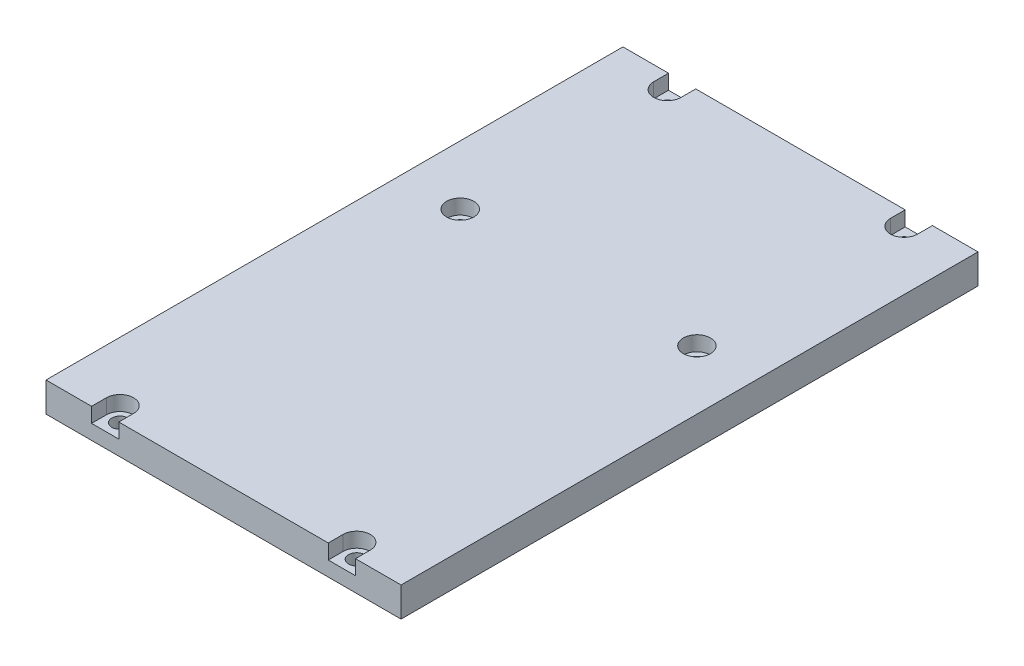
ISO-10303-21;
HEADER;
FILE_DESCRIPTION(('STEP AP214'),'2;1');
FILE_NAME('part.step','',(''),(''),'','','');
FILE_SCHEMA(('AUTOMOTIVE_DESIGN { 1 0 10303 214 1 1 1 1 }'));
ENDSEC;
DATA;
#1=APPLICATION_CONTEXT('core data for automotive mechanical design processes');
#2=APPLICATION_PROTOCOL_DEFINITION('international standard','automotive_design',2000,#1);
#3=PRODUCT_CONTEXT('',#1,'mechanical');
#4=PRODUCT('Part','Part','',(#3));
#5=PRODUCT_RELATED_PRODUCT_CATEGORY('part','',(#4));
#6=PRODUCT_DEFINITION_FORMATION('','',#4);
#7=PRODUCT_DEFINITION_CONTEXT('part definition',#1,'design');
#8=PRODUCT_DEFINITION('design','',#6,#7);
#9=PRODUCT_DEFINITION_SHAPE('','',#8);
#10=(LENGTH_UNIT() NAMED_UNIT(*) SI_UNIT(.MILLI.,.METRE.));
#11=(NAMED_UNIT(*) PLANE_ANGLE_UNIT() SI_UNIT($,.RADIAN.));
#12=(NAMED_UNIT(*) SI_UNIT($,.STERADIAN.) SOLID_ANGLE_UNIT());
#13=UNCERTAINTY_MEASURE_WITH_UNIT(LENGTH_MEASURE(1.E-05),#10,'distance_accuracy_value','');
#14=(GEOMETRIC_REPRESENTATION_CONTEXT(3) GLOBAL_UNCERTAINTY_ASSIGNED_CONTEXT((#13)) GLOBAL_UNIT_ASSIGNED_CONTEXT((#10,
#11,#12)) REPRESENTATION_CONTEXT('',''));
#15=CARTESIAN_POINT('',(0.,0.,0.));
#16=DIRECTION('',(0.,0.,1.));
#17=DIRECTION('',(1.,0.,0.));
#18=AXIS2_PLACEMENT_3D('',#15,#16,#17);
#19=CARTESIAN_POINT('',(-57.4277992722671,0.,-66.2487077993988));
#20=DIRECTION('',(0.,1.,0.));
#21=DIRECTION('',(0.,0.,1.));
#22=AXIS2_PLACEMENT_3D('',#19,#20,#21);
#23=CYLINDRICAL_SURFACE('',#22,2.75);
#24=CARTESIAN_POINT('',(-57.4277992722671,0.,-66.2487077993988));
#25=DIRECTION('',(0.,1.,0.));
#26=DIRECTION('',(0.,0.,1.));
#27=AXIS2_PLACEMENT_3D('',#24,#25,#26);
#28=CIRCLE('',#27,2.75);
#29=CARTESIAN_POINT('',(-57.4277992722671,0.,-63.4987077993988));
#30=VERTEX_POINT('',#29);
#31=EDGE_CURVE('E307',#30,#30,#28,.T.);
#32=ORIENTED_EDGE('',*,*,#31,.F.);
#33=EDGE_LOOP('',(#32));
#34=FACE_BOUND('',#33,.T.);
#35=CARTESIAN_POINT('',(-57.4277992722671,5.,-66.2487077993988));
#36=DIRECTION('',(0.,1.,0.));
#37=DIRECTION('',(0.,0.,1.));
#38=AXIS2_PLACEMENT_3D('',#35,#36,#37);
#39=CIRCLE('',#38,2.75);
#40=CARTESIAN_POINT('',(-57.4277992722671,5.,-63.4987077993988));
#41=VERTEX_POINT('',#40);
#42=EDGE_CURVE('E37',#41,#41,#39,.F.);
#43=ORIENTED_EDGE('',*,*,#42,.F.);
#44=EDGE_LOOP('',(#43));
#45=FACE_BOUND('',#44,.T.);
#46=ADVANCED_FACE('F33',(#34,#45),#23,.F.);
#47=CARTESIAN_POINT('',(22.572200727733,0.,-66.2487077993988));
#48=DIRECTION('',(0.,1.,0.));
#49=DIRECTION('',(0.,0.,1.));
#50=AXIS2_PLACEMENT_3D('',#47,#48,#49);
#51=CYLINDRICAL_SURFACE('',#50,2.75);
#52=CARTESIAN_POINT('',(22.572200727733,0.,-66.2487077993988));
#53=DIRECTION('',(0.,1.,0.));
#54=DIRECTION('',(0.,0.,1.));
#55=AXIS2_PLACEMENT_3D('',#52,#53,#54);
#56=CIRCLE('',#55,2.75);
#57=CARTESIAN_POINT('',(22.572200727733,0.,-63.4987077993988));
#58=VERTEX_POINT('',#57);
#59=EDGE_CURVE('E310',#58,#58,#56,.T.);
#60=ORIENTED_EDGE('',*,*,#59,.F.);
#61=EDGE_LOOP('',(#60));
#62=FACE_BOUND('',#61,.T.);
#63=CARTESIAN_POINT('',(22.572200727733,5.,-66.2487077993988));
#64=DIRECTION('',(0.,1.,0.));
#65=DIRECTION('',(0.,0.,1.));
#66=AXIS2_PLACEMENT_3D('',#63,#64,#65);
#67=CIRCLE('',#66,2.75);
#68=CARTESIAN_POINT('',(22.572200727733,5.,-63.4987077993988));
#69=VERTEX_POINT('',#68);
#70=EDGE_CURVE('E227',#69,#69,#67,.F.);
#71=ORIENTED_EDGE('',*,*,#70,.F.);
#72=EDGE_LOOP('',(#71));
#73=FACE_BOUND('',#72,.T.);
#74=ADVANCED_FACE('F369',(#62,#73),#51,.F.);
#75=CARTESIAN_POINT('',(-57.4277992722671,0.,118.751292200601));
#76=DIRECTION('',(0.,1.,0.));
#77=DIRECTION('',(0.,0.,1.));
#78=AXIS2_PLACEMENT_3D('',#75,#76,#77);
#79=CYLINDRICAL_SURFACE('',#78,2.75);
#80=CARTESIAN_POINT('',(-57.4277992722671,0.,118.751292200601));
#81=DIRECTION('',(0.,1.,0.));
#82=DIRECTION('',(0.,0.,1.));
#83=AXIS2_PLACEMENT_3D('',#80,#81,#82);
#84=CIRCLE('',#83,2.75);
#85=CARTESIAN_POINT('',(-57.4277992722671,0.,121.501292200601));
#86=VERTEX_POINT('',#85);
#87=EDGE_CURVE('E319',#86,#86,#84,.T.);
#88=ORIENTED_EDGE('',*,*,#87,.F.);
#89=EDGE_LOOP('',(#88));
#90=FACE_BOUND('',#89,.T.);
#91=CARTESIAN_POINT('',(-57.4277992722671,5.,118.751292200601));
#92=DIRECTION('',(0.,1.,0.));
#93=DIRECTION('',(0.,0.,1.));
#94=AXIS2_PLACEMENT_3D('',#91,#92,#93);
#95=CIRCLE('',#94,2.75);
#96=CARTESIAN_POINT('',(-57.4277992722671,5.,121.501292200601));
#97=VERTEX_POINT('',#96);
#98=EDGE_CURVE('E255',#97,#97,#95,.F.);
#99=ORIENTED_EDGE('',*,*,#98,.F.);
#100=EDGE_LOOP('',(#99));
#101=FACE_BOUND('',#100,.T.);
#102=ADVANCED_FACE('F371',(#90,#101),#79,.F.);
#103=CARTESIAN_POINT('',(-57.4277992722671,0.,3.75129220060118));
#104=DIRECTION('',(0.,1.,0.));
#105=DIRECTION('',(0.,0.,1.));
#106=AXIS2_PLACEMENT_3D('',#103,#104,#105);
#107=CYLINDRICAL_SURFACE('',#106,2.75);
#108=CARTESIAN_POINT('',(-57.4277992722671,0.,3.75129220060118));
#109=DIRECTION('',(0.,1.,0.));
#110=DIRECTION('',(0.,0.,1.));
#111=AXIS2_PLACEMENT_3D('',#108,#109,#110);
#112=CIRCLE('',#111,2.75);
#113=CARTESIAN_POINT('',(-57.4277992722671,0.,6.50129220060118));
#114=VERTEX_POINT('',#113);
#115=EDGE_CURVE('E313',#114,#114,#112,.T.);
#116=ORIENTED_EDGE('',*,*,#115,.F.);
#117=EDGE_LOOP('',(#116));
#118=FACE_BOUND('',#117,.T.);
#119=CARTESIAN_POINT('',(-57.4277992722671,5.,3.75129220060118));
#120=DIRECTION('',(0.,1.,0.));
#121=DIRECTION('',(0.,0.,1.));
#122=AXIS2_PLACEMENT_3D('',#119,#120,#121);
#123=CIRCLE('',#122,2.75);
#124=CARTESIAN_POINT('',(-57.4277992722671,5.,6.50129220060118));
#125=VERTEX_POINT('',#124);
#126=EDGE_CURVE('E266',#125,#125,#123,.F.);
#127=ORIENTED_EDGE('',*,*,#126,.F.);
#128=EDGE_LOOP('',(#127));
#129=FACE_BOUND('',#128,.T.);
#130=ADVANCED_FACE('F378',(#118,#129),#107,.F.);
#131=CARTESIAN_POINT('',(22.572200727733,0.,3.75129220060118));
#132=DIRECTION('',(0.,1.,0.));
#133=DIRECTION('',(0.,0.,1.));
#134=AXIS2_PLACEMENT_3D('',#131,#132,#133);
#135=CYLINDRICAL_SURFACE('',#134,2.75);
#136=CARTESIAN_POINT('',(22.572200727733,0.,3.75129220060118));
#137=DIRECTION('',(0.,1.,0.));
#138=DIRECTION('',(0.,0.,1.));
#139=AXIS2_PLACEMENT_3D('',#136,#137,#138);
#140=CIRCLE('',#139,2.75);
#141=CARTESIAN_POINT('',(22.572200727733,0.,6.50129220060118));
#142=VERTEX_POINT('',#141);
#143=EDGE_CURVE('E316',#142,#142,#140,.T.);
#144=ORIENTED_EDGE('',*,*,#143,.F.);
#145=EDGE_LOOP('',(#144));
#146=FACE_BOUND('',#145,.T.);
#147=CARTESIAN_POINT('',(22.572200727733,5.,3.75129220060118));
#148=DIRECTION('',(0.,1.,0.));
#149=DIRECTION('',(0.,0.,1.));
#150=AXIS2_PLACEMENT_3D('',#147,#148,#149);
#151=CIRCLE('',#150,2.75);
#152=CARTESIAN_POINT('',(22.572200727733,5.,6.50129220060118));
#153=VERTEX_POINT('',#152);
#154=EDGE_CURVE('E273',#153,#153,#151,.F.);
#155=ORIENTED_EDGE('',*,*,#154,.F.);
#156=EDGE_LOOP('',(#155));
#157=FACE_BOUND('',#156,.T.);
#158=ADVANCED_FACE('F388',(#146,#157),#135,.F.);
#159=CARTESIAN_POINT('',(22.572200727733,0.,118.751292200601));
#160=DIRECTION('',(0.,1.,0.));
#161=DIRECTION('',(0.,0.,1.));
#162=AXIS2_PLACEMENT_3D('',#159,#160,#161);
#163=CYLINDRICAL_SURFACE('',#162,2.75);
#164=CARTESIAN_POINT('',(22.572200727733,0.,118.751292200601));
#165=DIRECTION('',(0.,1.,0.));
#166=DIRECTION('',(0.,0.,1.));
#167=AXIS2_PLACEMENT_3D('',#164,#165,#166);
#168=CIRCLE('',#167,2.75);
#169=CARTESIAN_POINT('',(22.572200727733,0.,121.501292200601));
#170=VERTEX_POINT('',#169);
#171=EDGE_CURVE('E322',#170,#170,#168,.T.);
#172=ORIENTED_EDGE('',*,*,#171,.F.);
#173=EDGE_LOOP('',(#172));
#174=FACE_BOUND('',#173,.T.);
#175=CARTESIAN_POINT('',(22.572200727733,5.,118.751292200601));
#176=DIRECTION('',(0.,1.,0.));
#177=DIRECTION('',(0.,0.,1.));
#178=AXIS2_PLACEMENT_3D('',#175,#176,#177);
#179=CIRCLE('',#178,2.75);
#180=CARTESIAN_POINT('',(22.572200727733,5.,121.501292200601));
#181=VERTEX_POINT('',#180);
#182=EDGE_CURVE('E299',#181,#181,#179,.F.);
#183=ORIENTED_EDGE('',*,*,#182,.F.);
#184=EDGE_LOOP('',(#183));
#185=FACE_BOUND('',#184,.T.);
#186=ADVANCED_FACE('F391',(#174,#185),#163,.F.);
#187=CARTESIAN_POINT('',(-77.4277992722671,10.,-71.2487077993988));
#188=DIRECTION('',(1.,0.,0.));
#189=DIRECTION('',(0.,0.,-1.));
#190=AXIS2_PLACEMENT_3D('',#187,#188,#189);
#191=PLANE('',#190);
#192=DIRECTION('',(0.,0.,1.));
#193=VECTOR('',#192,1.);
#194=CARTESIAN_POINT('',(-77.4277992722671,0.,-71.2487077993988));
#195=LINE('',#194,#193);
#196=CARTESIAN_POINT('',(-77.4277992722671,0.,-71.2487077993988));
#197=VERTEX_POINT('',#196);
#198=CARTESIAN_POINT('',(-77.427799272267,0.,123.751292200601));
#199=VERTEX_POINT('',#198);
#200=EDGE_CURVE('E325',#197,#199,#195,.T.);
#201=ORIENTED_EDGE('',*,*,#200,.T.);
#202=DIRECTION('',(0.,-1.,0.));
#203=VECTOR('',#202,1.);
#204=CARTESIAN_POINT('',(-77.427799272267,10.,123.751292200601));
#205=LINE('',#204,#203);
#206=CARTESIAN_POINT('',(-77.427799272267,10.,123.751292200601));
#207=VERTEX_POINT('',#206);
#208=EDGE_CURVE('E11',#207,#199,#205,.T.);
#209=ORIENTED_EDGE('',*,*,#208,.F.);
#210=DIRECTION('',(0.,0.,1.));
#211=VECTOR('',#210,1.);
#212=CARTESIAN_POINT('',(-77.4277992722671,10.,-71.2487077993988));
#213=LINE('',#212,#211);
#214=CARTESIAN_POINT('',(-77.4277992722671,10.,-71.2487077993988));
#215=VERTEX_POINT('',#214);
#216=EDGE_CURVE('E326',#215,#207,#213,.T.);
#217=ORIENTED_EDGE('',*,*,#216,.F.);
#218=DIRECTION('',(0.,-1.,0.));
#219=VECTOR('',#218,1.);
#220=CARTESIAN_POINT('',(-77.4277992722671,10.,-71.2487077993988));
#221=LINE('',#220,#219);
#222=EDGE_CURVE('E341',#215,#197,#221,.T.);
#223=ORIENTED_EDGE('',*,*,#222,.T.);
#224=EDGE_LOOP('',(#201,#209,#217,#223));
#225=FACE_BOUND('',#224,.T.);
#226=ADVANCED_FACE('F35',(#225),#191,.F.);
#227=CARTESIAN_POINT('',(-77.427799272267,10.,123.751292200601));
#228=DIRECTION('',(0.,0.,-1.));
#229=DIRECTION('',(-1.,0.,0.));
#230=AXIS2_PLACEMENT_3D('',#227,#228,#229);
#231=PLANE('',#230);
#232=DIRECTION('',(1.,0.,0.));
#233=VECTOR('',#232,1.);
#234=CARTESIAN_POINT('',(-77.427799272267,10.,123.751292200601));
#235=LINE('',#234,#233);
#236=CARTESIAN_POINT('',(-52.8277992722671,10.,123.751292200601));
#237=VERTEX_POINT('',#236);
#238=CARTESIAN_POINT('',(17.9722007277329,10.,123.751292200601));
#239=VERTEX_POINT('',#238);
#240=EDGE_CURVE('E335',#237,#239,#235,.T.);
#241=ORIENTED_EDGE('',*,*,#240,.F.);
#242=DIRECTION('',(0.,1.,0.));
#243=VECTOR('',#242,1.);
#244=CARTESIAN_POINT('',(-52.8277992722671,5.,123.751292200601));
#245=LINE('',#244,#243);
#246=CARTESIAN_POINT('',(-52.8277992722671,5.,123.751292200601));
#247=VERTEX_POINT('',#246);
#248=EDGE_CURVE('E256',#247,#237,#245,.T.);
#249=ORIENTED_EDGE('',*,*,#248,.F.);
#250=DIRECTION('',(1.,0.,0.));
#251=VECTOR('',#250,1.);
#252=CARTESIAN_POINT('',(-62.0277992722671,5.,123.751292200601));
#253=LINE('',#252,#251);
#254=CARTESIAN_POINT('',(-62.0277992722671,5.,123.751292200601));
#255=VERTEX_POINT('',#254);
#256=EDGE_CURVE('E241',#255,#247,#253,.T.);
#257=ORIENTED_EDGE('',*,*,#256,.F.);
#258=DIRECTION('',(0.,1.,0.));
#259=VECTOR('',#258,1.);
#260=CARTESIAN_POINT('',(-62.0277992722671,5.,123.751292200601));
#261=LINE('',#260,#259);
#262=CARTESIAN_POINT('',(-62.0277992722671,10.,123.751292200601));
#263=VERTEX_POINT('',#262);
#264=EDGE_CURVE('E258',#255,#263,#261,.T.);
#265=ORIENTED_EDGE('',*,*,#264,.T.);
#266=EDGE_CURVE('E331',#207,#263,#235,.T.);
#267=ORIENTED_EDGE('',*,*,#266,.F.);
#268=ORIENTED_EDGE('',*,*,#208,.T.);
#269=DIRECTION('',(1.,0.,0.));
#270=VECTOR('',#269,1.);
#271=CARTESIAN_POINT('',(-77.427799272267,0.,123.751292200601));
#272=LINE('',#271,#270);
#273=CARTESIAN_POINT('',(42.572200727733,0.,123.751292200601));
#274=VERTEX_POINT('',#273);
#275=EDGE_CURVE('E345',#199,#274,#272,.T.);
#276=ORIENTED_EDGE('',*,*,#275,.T.);
#277=DIRECTION('',(0.,-1.,0.));
#278=VECTOR('',#277,1.);
#279=CARTESIAN_POINT('',(42.572200727733,10.,123.751292200601));
#280=LINE('',#279,#278);
#281=CARTESIAN_POINT('',(42.572200727733,10.,123.751292200601));
#282=VERTEX_POINT('',#281);
#283=EDGE_CURVE('E42',#282,#274,#280,.T.);
#284=ORIENTED_EDGE('',*,*,#283,.F.);
#285=CARTESIAN_POINT('',(27.1722007277329,10.,123.751292200601));
#286=VERTEX_POINT('',#285);
#287=EDGE_CURVE('E329',#286,#282,#235,.T.);
#288=ORIENTED_EDGE('',*,*,#287,.F.);
#289=DIRECTION('',(0.,1.,0.));
#290=VECTOR('',#289,1.);
#291=CARTESIAN_POINT('',(27.1722007277329,5.,123.751292200601));
#292=LINE('',#291,#290);
#293=CARTESIAN_POINT('',(27.1722007277329,5.,123.751292200601));
#294=VERTEX_POINT('',#293);
#295=EDGE_CURVE('E300',#294,#286,#292,.T.);
#296=ORIENTED_EDGE('',*,*,#295,.F.);
#297=DIRECTION('',(1.,0.,0.));
#298=VECTOR('',#297,1.);
#299=CARTESIAN_POINT('',(17.9722007277329,5.,123.751292200601));
#300=LINE('',#299,#298);
#301=CARTESIAN_POINT('',(17.9722007277329,5.,123.751292200601));
#302=VERTEX_POINT('',#301);
#303=EDGE_CURVE('E284',#302,#294,#300,.T.);
#304=ORIENTED_EDGE('',*,*,#303,.F.);
#305=DIRECTION('',(0.,1.,0.));
#306=VECTOR('',#305,1.);
#307=CARTESIAN_POINT('',(17.9722007277329,5.,123.751292200601));
#308=LINE('',#307,#306);
#309=EDGE_CURVE('E302',#302,#239,#308,.T.);
#310=ORIENTED_EDGE('',*,*,#309,.T.);
#311=EDGE_LOOP('',(#241,#249,#257,#265,#267,#268,#276,#284,#288,#296,#304,#310));
#312=FACE_BOUND('',#311,.T.);
#313=ADVANCED_FACE('F412',(#312),#231,.F.);
#314=CARTESIAN_POINT('',(42.5722007277329,10.,-71.2487077993988));
#315=DIRECTION('',(-1.,0.,0.));
#316=DIRECTION('',(0.,0.,1.));
#317=AXIS2_PLACEMENT_3D('',#314,#315,#316);
#318=PLANE('',#317);
#319=DIRECTION('',(0.,0.,-1.));
#320=VECTOR('',#319,1.);
#321=CARTESIAN_POINT('',(42.5722007277329,0.,-71.2487077993988));
#322=LINE('',#321,#320);
#323=CARTESIAN_POINT('',(42.5722007277329,0.,-71.2487077993988));
#324=VERTEX_POINT('',#323);
#325=EDGE_CURVE('E347',#274,#324,#322,.T.);
#326=ORIENTED_EDGE('',*,*,#325,.T.);
#327=DIRECTION('',(0.,-1.,0.));
#328=VECTOR('',#327,1.);
#329=CARTESIAN_POINT('',(42.5722007277329,10.,-71.2487077993988));
#330=LINE('',#329,#328);
#331=CARTESIAN_POINT('',(42.5722007277329,10.,-71.2487077993988));
#332=VERTEX_POINT('',#331);
#333=EDGE_CURVE('E352',#332,#324,#330,.T.);
#334=ORIENTED_EDGE('',*,*,#333,.F.);
#335=DIRECTION('',(0.,0.,-1.));
#336=VECTOR('',#335,1.);
#337=CARTESIAN_POINT('',(42.5722007277329,10.,-71.2487077993988));
#338=LINE('',#337,#336);
#339=EDGE_CURVE('E334',#282,#332,#338,.T.);
#340=ORIENTED_EDGE('',*,*,#339,.F.);
#341=ORIENTED_EDGE('',*,*,#283,.T.);
#342=EDGE_LOOP('',(#326,#334,#340,#341));
#343=FACE_BOUND('',#342,.T.);
#344=ADVANCED_FACE('F409',(#343),#318,.F.);
#345=CARTESIAN_POINT('',(-77.4277992722671,10.,-71.2487077993988));
#346=DIRECTION('',(0.,0.,1.));
#347=DIRECTION('',(1.,0.,0.));
#348=AXIS2_PLACEMENT_3D('',#345,#346,#347);
#349=PLANE('',#348);
#350=DIRECTION('',(-1.,0.,0.));
#351=VECTOR('',#350,1.);
#352=CARTESIAN_POINT('',(-77.4277992722671,10.,-71.2487077993988));
#353=LINE('',#352,#351);
#354=CARTESIAN_POINT('',(-62.0277992722671,10.,-71.2487077993988));
#355=VERTEX_POINT('',#354);
#356=EDGE_CURVE('E337',#355,#215,#353,.T.);
#357=ORIENTED_EDGE('',*,*,#356,.F.);
#358=DIRECTION('',(0.,1.,0.));
#359=VECTOR('',#358,1.);
#360=CARTESIAN_POINT('',(-62.0277992722671,5.,-71.2487077993988));
#361=LINE('',#360,#359);
#362=CARTESIAN_POINT('',(-62.0277992722671,5.,-71.2487077993988));
#363=VERTEX_POINT('',#362);
#364=EDGE_CURVE('E204',#363,#355,#361,.T.);
#365=ORIENTED_EDGE('',*,*,#364,.F.);
#366=DIRECTION('',(-1.,0.,0.));
#367=VECTOR('',#366,1.);
#368=CARTESIAN_POINT('',(-62.0277992722671,5.,-71.2487077993988));
#369=LINE('',#368,#367);
#370=CARTESIAN_POINT('',(-52.8277992722671,5.,-71.2487077993988));
#371=VERTEX_POINT('',#370);
#372=EDGE_CURVE('E187',#371,#363,#369,.T.);
#373=ORIENTED_EDGE('',*,*,#372,.F.);
#374=DIRECTION('',(0.,1.,0.));
#375=VECTOR('',#374,1.);
#376=CARTESIAN_POINT('',(-52.8277992722671,5.,-71.2487077993988));
#377=LINE('',#376,#375);
#378=CARTESIAN_POINT('',(-52.8277992722671,10.,-71.2487077993988));
#379=VERTEX_POINT('',#378);
#380=EDGE_CURVE('E178',#371,#379,#377,.T.);
#381=ORIENTED_EDGE('',*,*,#380,.T.);
#382=CARTESIAN_POINT('',(17.972200727733,10.,-71.2487077993988));
#383=VERTEX_POINT('',#382);
#384=EDGE_CURVE('E342',#383,#379,#353,.T.);
#385=ORIENTED_EDGE('',*,*,#384,.F.);
#386=DIRECTION('',(0.,1.,0.));
#387=VECTOR('',#386,1.);
#388=CARTESIAN_POINT('',(17.972200727733,5.,-71.2487077993988));
#389=LINE('',#388,#387);
#390=CARTESIAN_POINT('',(17.972200727733,5.,-71.2487077993988));
#391=VERTEX_POINT('',#390);
#392=EDGE_CURVE('E228',#391,#383,#389,.T.);
#393=ORIENTED_EDGE('',*,*,#392,.F.);
#394=DIRECTION('',(-1.,0.,0.));
#395=VECTOR('',#394,1.);
#396=CARTESIAN_POINT('',(17.972200727733,5.,-71.2487077993988));
#397=LINE('',#396,#395);
#398=CARTESIAN_POINT('',(27.172200727733,5.,-71.2487077993988));
#399=VERTEX_POINT('',#398);
#400=EDGE_CURVE('E214',#399,#391,#397,.T.);
#401=ORIENTED_EDGE('',*,*,#400,.F.);
#402=DIRECTION('',(0.,1.,0.));
#403=VECTOR('',#402,1.);
#404=CARTESIAN_POINT('',(27.172200727733,5.,-71.2487077993988));
#405=LINE('',#404,#403);
#406=CARTESIAN_POINT('',(27.172200727733,10.,-71.2487077993988));
#407=VERTEX_POINT('',#406);
#408=EDGE_CURVE('E230',#399,#407,#405,.T.);
#409=ORIENTED_EDGE('',*,*,#408,.T.);
#410=EDGE_CURVE('E338',#332,#407,#353,.T.);
#411=ORIENTED_EDGE('',*,*,#410,.F.);
#412=ORIENTED_EDGE('',*,*,#333,.T.);
#413=DIRECTION('',(-1.,0.,0.));
#414=VECTOR('',#413,1.);
#415=CARTESIAN_POINT('',(-77.4277992722671,0.,-71.2487077993988));
#416=LINE('',#415,#414);
#417=EDGE_CURVE('E330',#324,#197,#416,.T.);
#418=ORIENTED_EDGE('',*,*,#417,.T.);
#419=ORIENTED_EDGE('',*,*,#222,.F.);
#420=EDGE_LOOP('',(#357,#365,#373,#381,#385,#393,#401,#409,#411,#412,#418,#419));
#421=FACE_BOUND('',#420,.T.);
#422=ADVANCED_FACE('F401',(#421),#349,.F.);
#423=CARTESIAN_POINT('',(-77.427799272267,10.,123.751292200601));
#424=DIRECTION('',(0.,1.,0.));
#425=DIRECTION('',(0.,0.,1.));
#426=AXIS2_PLACEMENT_3D('',#423,#424,#425);
#427=PLANE('',#426);
#428=DIRECTION('',(0.,0.,1.));
#429=VECTOR('',#428,1.);
#430=CARTESIAN_POINT('',(-62.0277992722671,10.,-66.2487077993988));
#431=LINE('',#430,#429);
#432=CARTESIAN_POINT('',(-62.0277992722671,10.,-66.2487077993988));
#433=VERTEX_POINT('',#432);
#434=EDGE_CURVE('E192',#355,#433,#431,.T.);
#435=ORIENTED_EDGE('',*,*,#434,.F.);
#436=ORIENTED_EDGE('',*,*,#356,.T.);
#437=ORIENTED_EDGE('',*,*,#216,.T.);
#438=ORIENTED_EDGE('',*,*,#266,.T.);
#439=DIRECTION('',(0.,0.,1.));
#440=VECTOR('',#439,1.);
#441=CARTESIAN_POINT('',(-62.0277992722671,10.,118.751292200601));
#442=LINE('',#441,#440);
#443=CARTESIAN_POINT('',(-62.0277992722671,10.,118.751292200601));
#444=VERTEX_POINT('',#443);
#445=EDGE_CURVE('E249',#444,#263,#442,.T.);
#446=ORIENTED_EDGE('',*,*,#445,.F.);
#447=CARTESIAN_POINT('',(-57.4277992722671,10.,118.751292200601));
#448=DIRECTION('',(0.,1.,0.));
#449=DIRECTION('',(0.,0.,1.));
#450=AXIS2_PLACEMENT_3D('',#447,#448,#449);
#451=CIRCLE('',#450,4.6);
#452=CARTESIAN_POINT('',(-52.8277992722671,10.,118.751292200601));
#453=VERTEX_POINT('',#452);
#454=EDGE_CURVE('E247',#453,#444,#451,.T.);
#455=ORIENTED_EDGE('',*,*,#454,.F.);
#456=DIRECTION('',(0.,0.,-1.));
#457=VECTOR('',#456,1.);
#458=CARTESIAN_POINT('',(-52.8277992722671,10.,123.751292200601));
#459=LINE('',#458,#457);
#460=EDGE_CURVE('E238',#237,#453,#459,.T.);
#461=ORIENTED_EDGE('',*,*,#460,.F.);
#462=ORIENTED_EDGE('',*,*,#240,.T.);
#463=DIRECTION('',(0.,0.,1.));
#464=VECTOR('',#463,1.);
#465=CARTESIAN_POINT('',(17.972200727733,10.,118.751292200601));
#466=LINE('',#465,#464);
#467=CARTESIAN_POINT('',(17.972200727733,10.,118.751292200601));
#468=VERTEX_POINT('',#467);
#469=EDGE_CURVE('E292',#468,#239,#466,.T.);
#470=ORIENTED_EDGE('',*,*,#469,.F.);
#471=CARTESIAN_POINT('',(22.572200727733,10.,118.751292200601));
#472=DIRECTION('',(0.,1.,0.));
#473=DIRECTION('',(0.,0.,1.));
#474=AXIS2_PLACEMENT_3D('',#471,#472,#473);
#475=CIRCLE('',#474,4.6);
#476=CARTESIAN_POINT('',(27.172200727733,10.,118.751292200601));
#477=VERTEX_POINT('',#476);
#478=EDGE_CURVE('E290',#477,#468,#475,.T.);
#479=ORIENTED_EDGE('',*,*,#478,.F.);
#480=DIRECTION('',(0.,0.,-1.));
#481=VECTOR('',#480,1.);
#482=CARTESIAN_POINT('',(27.1722007277329,10.,123.751292200601));
#483=LINE('',#482,#481);
#484=EDGE_CURVE('E281',#286,#477,#483,.T.);
#485=ORIENTED_EDGE('',*,*,#484,.F.);
#486=ORIENTED_EDGE('',*,*,#287,.T.);
#487=ORIENTED_EDGE('',*,*,#339,.T.);
#488=ORIENTED_EDGE('',*,*,#410,.T.);
#489=DIRECTION('',(0.,0.,-1.));
#490=VECTOR('',#489,1.);
#491=CARTESIAN_POINT('',(27.172200727733,10.,-66.2487077993988));
#492=LINE('',#491,#490);
#493=CARTESIAN_POINT('',(27.1722007277329,10.,-66.2487077993988));
#494=VERTEX_POINT('',#493);
#495=EDGE_CURVE('E221',#494,#407,#492,.T.);
#496=ORIENTED_EDGE('',*,*,#495,.F.);
#497=CARTESIAN_POINT('',(22.572200727733,10.,-66.2487077993988));
#498=DIRECTION('',(0.,1.,0.));
#499=DIRECTION('',(0.,0.,1.));
#500=AXIS2_PLACEMENT_3D('',#497,#498,#499);
#501=CIRCLE('',#500,4.6);
#502=CARTESIAN_POINT('',(17.972200727733,10.,-66.2487077993988));
#503=VERTEX_POINT('',#502);
#504=EDGE_CURVE('E58',#503,#494,#501,.T.);
#505=ORIENTED_EDGE('',*,*,#504,.F.);
#506=DIRECTION('',(0.,0.,1.));
#507=VECTOR('',#506,1.);
#508=CARTESIAN_POINT('',(17.972200727733,10.,-66.2487077993988));
#509=LINE('',#508,#507);
#510=EDGE_CURVE('E211',#383,#503,#509,.T.);
#511=ORIENTED_EDGE('',*,*,#510,.F.);
#512=ORIENTED_EDGE('',*,*,#384,.T.);
#513=DIRECTION('',(0.,0.,-1.));
#514=VECTOR('',#513,1.);
#515=CARTESIAN_POINT('',(-52.8277992722671,10.,-71.2487077993988));
#516=LINE('',#515,#514);
#517=CARTESIAN_POINT('',(-52.8277992722671,10.,-66.2487077993988));
#518=VERTEX_POINT('',#517);
#519=EDGE_CURVE('E195',#518,#379,#516,.T.);
#520=ORIENTED_EDGE('',*,*,#519,.F.);
#521=CARTESIAN_POINT('',(-57.4277992722671,10.,-66.2487077993988));
#522=DIRECTION('',(0.,1.,0.));
#523=DIRECTION('',(0.,0.,1.));
#524=AXIS2_PLACEMENT_3D('',#521,#522,#523);
#525=CIRCLE('',#524,4.6);
#526=EDGE_CURVE('E50',#433,#518,#525,.T.);
#527=ORIENTED_EDGE('',*,*,#526,.F.);
#528=EDGE_LOOP('',(#435,#436,#437,#438,#446,#455,#461,#462,#470,#479,#485,#486,#487,#488,#496,
#505,#511,#512,#520,#527));
#529=FACE_BOUND('',#528,.T.);
#530=CARTESIAN_POINT('',(-57.4277992722671,10.,3.75129220060118));
#531=DIRECTION('',(0.,1.,0.));
#532=DIRECTION('',(0.,0.,1.));
#533=AXIS2_PLACEMENT_3D('',#530,#531,#532);
#534=CIRCLE('',#533,4.6);
#535=CARTESIAN_POINT('',(-57.4277992722671,10.,8.35129220060118));
#536=VERTEX_POINT('',#535);
#537=EDGE_CURVE('E267',#536,#536,#534,.T.);
#538=ORIENTED_EDGE('',*,*,#537,.F.);
#539=EDGE_LOOP('',(#538));
#540=FACE_BOUND('',#539,.T.);
#541=CARTESIAN_POINT('',(22.572200727733,10.,3.75129220060118));
#542=DIRECTION('',(0.,1.,0.));
#543=DIRECTION('',(0.,0.,1.));
#544=AXIS2_PLACEMENT_3D('',#541,#542,#543);
#545=CIRCLE('',#544,4.6);
#546=CARTESIAN_POINT('',(22.572200727733,10.,8.35129220060118));
#547=VERTEX_POINT('',#546);
#548=EDGE_CURVE('E274',#547,#547,#545,.T.);
#549=ORIENTED_EDGE('',*,*,#548,.F.);
#550=EDGE_LOOP('',(#549));
#551=FACE_BOUND('',#550,.T.);
#552=ADVANCED_FACE('F397',(#529,#540,#551),#427,.T.);
#553=CARTESIAN_POINT('',(-77.427799272267,0.,123.751292200601));
#554=DIRECTION('',(0.,1.,0.));
#555=DIRECTION('',(0.,0.,1.));
#556=AXIS2_PLACEMENT_3D('',#553,#554,#555);
#557=PLANE('',#556);
#558=ORIENTED_EDGE('',*,*,#31,.T.);
#559=EDGE_LOOP('',(#558));
#560=FACE_BOUND('',#559,.T.);
#561=ORIENTED_EDGE('',*,*,#59,.T.);
#562=EDGE_LOOP('',(#561));
#563=FACE_BOUND('',#562,.T.);
#564=ORIENTED_EDGE('',*,*,#115,.T.);
#565=EDGE_LOOP('',(#564));
#566=FACE_BOUND('',#565,.T.);
#567=ORIENTED_EDGE('',*,*,#143,.T.);
#568=EDGE_LOOP('',(#567));
#569=FACE_BOUND('',#568,.T.);
#570=ORIENTED_EDGE('',*,*,#87,.T.);
#571=EDGE_LOOP('',(#570));
#572=FACE_BOUND('',#571,.T.);
#573=ORIENTED_EDGE('',*,*,#171,.T.);
#574=EDGE_LOOP('',(#573));
#575=FACE_BOUND('',#574,.T.);
#576=ORIENTED_EDGE('',*,*,#200,.F.);
#577=ORIENTED_EDGE('',*,*,#417,.F.);
#578=ORIENTED_EDGE('',*,*,#325,.F.);
#579=ORIENTED_EDGE('',*,*,#275,.F.);
#580=EDGE_LOOP('',(#576,#577,#578,#579));
#581=FACE_BOUND('',#580,.T.);
#582=ADVANCED_FACE('F400',(#560,#563,#566,#569,#572,#575,#581),#557,.F.);
#583=CARTESIAN_POINT('',(22.572200727733,5.,118.751292200601));
#584=DIRECTION('',(0.,1.,0.));
#585=DIRECTION('',(0.,0.,1.));
#586=AXIS2_PLACEMENT_3D('',#583,#584,#585);
#587=PLANE('',#586);
#588=CARTESIAN_POINT('',(22.572200727733,5.,118.751292200601));
#589=DIRECTION('',(0.,1.,0.));
#590=DIRECTION('',(0.,0.,1.));
#591=AXIS2_PLACEMENT_3D('',#588,#589,#590);
#592=CIRCLE('',#591,4.6);
#593=CARTESIAN_POINT('',(27.172200727733,5.,118.751292200601));
#594=VERTEX_POINT('',#593);
#595=CARTESIAN_POINT('',(17.972200727733,5.,118.751292200601));
#596=VERTEX_POINT('',#595);
#597=EDGE_CURVE('E277',#594,#596,#592,.T.);
#598=ORIENTED_EDGE('',*,*,#597,.T.);
#599=DIRECTION('',(0.,0.,1.));
#600=VECTOR('',#599,1.);
#601=CARTESIAN_POINT('',(17.972200727733,5.,118.751292200601));
#602=LINE('',#601,#600);
#603=EDGE_CURVE('E280',#596,#302,#602,.T.);
#604=ORIENTED_EDGE('',*,*,#603,.T.);
#605=ORIENTED_EDGE('',*,*,#303,.T.);
#606=DIRECTION('',(0.,0.,-1.));
#607=VECTOR('',#606,1.);
#608=CARTESIAN_POINT('',(27.1722007277329,5.,123.751292200601));
#609=LINE('',#608,#607);
#610=EDGE_CURVE('E286',#294,#594,#609,.T.);
#611=ORIENTED_EDGE('',*,*,#610,.T.);
#612=EDGE_LOOP('',(#598,#604,#605,#611));
#613=FACE_BOUND('',#612,.T.);
#614=ORIENTED_EDGE('',*,*,#182,.T.);
#615=EDGE_LOOP('',(#614));
#616=FACE_BOUND('',#615,.T.);
#617=ADVANCED_FACE('F405',(#613,#616),#587,.T.);
#618=CARTESIAN_POINT('',(22.572200727733,5.,118.751292200601));
#619=DIRECTION('',(0.,1.,0.));
#620=DIRECTION('',(0.,0.,1.));
#621=AXIS2_PLACEMENT_3D('',#618,#619,#620);
#622=CYLINDRICAL_SURFACE('',#621,4.6);
#623=ORIENTED_EDGE('',*,*,#478,.T.);
#624=DIRECTION('',(0.,1.,0.));
#625=VECTOR('',#624,1.);
#626=CARTESIAN_POINT('',(17.972200727733,5.,118.751292200601));
#627=LINE('',#626,#625);
#628=EDGE_CURVE('E289',#596,#468,#627,.T.);
#629=ORIENTED_EDGE('',*,*,#628,.F.);
#630=ORIENTED_EDGE('',*,*,#597,.F.);
#631=DIRECTION('',(0.,1.,0.));
#632=VECTOR('',#631,1.);
#633=CARTESIAN_POINT('',(27.172200727733,5.,118.751292200601));
#634=LINE('',#633,#632);
#635=EDGE_CURVE('E297',#594,#477,#634,.T.);
#636=ORIENTED_EDGE('',*,*,#635,.T.);
#637=EDGE_LOOP('',(#623,#629,#630,#636));
#638=FACE_BOUND('',#637,.T.);
#639=ADVANCED_FACE('F507',(#638),#622,.F.);
#640=CARTESIAN_POINT('',(27.1722007277329,5.,123.751292200601));
#641=DIRECTION('',(1.,0.,0.));
#642=DIRECTION('',(0.,0.,-1.));
#643=AXIS2_PLACEMENT_3D('',#640,#641,#642);
#644=PLANE('',#643);
#645=ORIENTED_EDGE('',*,*,#484,.T.);
#646=ORIENTED_EDGE('',*,*,#635,.F.);
#647=ORIENTED_EDGE('',*,*,#610,.F.);
#648=ORIENTED_EDGE('',*,*,#295,.T.);
#649=EDGE_LOOP('',(#645,#646,#647,#648));
#650=FACE_BOUND('',#649,.T.);
#651=ADVANCED_FACE('F509',(#650),#644,.F.);
#652=CARTESIAN_POINT('',(17.972200727733,5.,118.751292200601));
#653=DIRECTION('',(-1.,0.,0.));
#654=DIRECTION('',(0.,0.,1.));
#655=AXIS2_PLACEMENT_3D('',#652,#653,#654);
#656=PLANE('',#655);
#657=ORIENTED_EDGE('',*,*,#469,.T.);
#658=ORIENTED_EDGE('',*,*,#309,.F.);
#659=ORIENTED_EDGE('',*,*,#603,.F.);
#660=ORIENTED_EDGE('',*,*,#628,.T.);
#661=EDGE_LOOP('',(#657,#658,#659,#660));
#662=FACE_BOUND('',#661,.T.);
#663=ADVANCED_FACE('F500',(#662),#656,.F.);
#664=CARTESIAN_POINT('',(22.572200727733,5.,3.75129220060118));
#665=DIRECTION('',(0.,1.,0.));
#666=DIRECTION('',(0.,0.,1.));
#667=AXIS2_PLACEMENT_3D('',#664,#665,#666);
#668=PLANE('',#667);
#669=CARTESIAN_POINT('',(22.572200727733,5.,3.75129220060118));
#670=DIRECTION('',(0.,1.,0.));
#671=DIRECTION('',(0.,0.,1.));
#672=AXIS2_PLACEMENT_3D('',#669,#670,#671);
#673=CIRCLE('',#672,4.6);
#674=CARTESIAN_POINT('',(22.572200727733,5.,8.35129220060118));
#675=VERTEX_POINT('',#674);
#676=EDGE_CURVE('E270',#675,#675,#673,.T.);
#677=ORIENTED_EDGE('',*,*,#676,.T.);
#678=EDGE_LOOP('',(#677));
#679=FACE_BOUND('',#678,.T.);
#680=ORIENTED_EDGE('',*,*,#154,.T.);
#681=EDGE_LOOP('',(#680));
#682=FACE_BOUND('',#681,.T.);
#683=ADVANCED_FACE('F497',(#679,#682),#668,.T.);
#684=CARTESIAN_POINT('',(22.572200727733,5.,3.75129220060118));
#685=DIRECTION('',(0.,1.,0.));
#686=DIRECTION('',(0.,0.,1.));
#687=AXIS2_PLACEMENT_3D('',#684,#685,#686);
#688=CYLINDRICAL_SURFACE('',#687,4.6);
#689=ORIENTED_EDGE('',*,*,#676,.F.);
#690=EDGE_LOOP('',(#689));
#691=FACE_BOUND('',#690,.T.);
#692=ORIENTED_EDGE('',*,*,#548,.T.);
#693=EDGE_LOOP('',(#692));
#694=FACE_BOUND('',#693,.T.);
#695=ADVANCED_FACE('F494',(#691,#694),#688,.F.);
#696=CARTESIAN_POINT('',(-57.4277992722671,5.,3.75129220060118));
#697=DIRECTION('',(0.,1.,0.));
#698=DIRECTION('',(0.,0.,1.));
#699=AXIS2_PLACEMENT_3D('',#696,#697,#698);
#700=PLANE('',#699);
#701=CARTESIAN_POINT('',(-57.4277992722671,5.,3.75129220060118));
#702=DIRECTION('',(0.,1.,0.));
#703=DIRECTION('',(0.,0.,1.));
#704=AXIS2_PLACEMENT_3D('',#701,#702,#703);
#705=CIRCLE('',#704,4.6);
#706=CARTESIAN_POINT('',(-57.4277992722671,5.,8.35129220060118));
#707=VERTEX_POINT('',#706);
#708=EDGE_CURVE('E263',#707,#707,#705,.T.);
#709=ORIENTED_EDGE('',*,*,#708,.T.);
#710=EDGE_LOOP('',(#709));
#711=FACE_BOUND('',#710,.T.);
#712=ORIENTED_EDGE('',*,*,#126,.T.);
#713=EDGE_LOOP('',(#712));
#714=FACE_BOUND('',#713,.T.);
#715=ADVANCED_FACE('F483',(#711,#714),#700,.T.);
#716=CARTESIAN_POINT('',(-57.4277992722671,5.,3.75129220060118));
#717=DIRECTION('',(0.,1.,0.));
#718=DIRECTION('',(0.,0.,1.));
#719=AXIS2_PLACEMENT_3D('',#716,#717,#718);
#720=CYLINDRICAL_SURFACE('',#719,4.6);
#721=ORIENTED_EDGE('',*,*,#708,.F.);
#722=EDGE_LOOP('',(#721));
#723=FACE_BOUND('',#722,.T.);
#724=ORIENTED_EDGE('',*,*,#537,.T.);
#725=EDGE_LOOP('',(#724));
#726=FACE_BOUND('',#725,.T.);
#727=ADVANCED_FACE('F474',(#723,#726),#720,.F.);
#728=CARTESIAN_POINT('',(-57.4277992722671,5.,118.751292200601));
#729=DIRECTION('',(0.,1.,0.));
#730=DIRECTION('',(0.,0.,1.));
#731=AXIS2_PLACEMENT_3D('',#728,#729,#730);
#732=PLANE('',#731);
#733=CARTESIAN_POINT('',(-57.4277992722671,5.,118.751292200601));
#734=DIRECTION('',(0.,1.,0.));
#735=DIRECTION('',(0.,0.,1.));
#736=AXIS2_PLACEMENT_3D('',#733,#734,#735);
#737=CIRCLE('',#736,4.6);
#738=CARTESIAN_POINT('',(-52.8277992722671,5.,118.751292200601));
#739=VERTEX_POINT('',#738);
#740=CARTESIAN_POINT('',(-62.0277992722671,5.,118.751292200601));
#741=VERTEX_POINT('',#740);
#742=EDGE_CURVE('E234',#739,#741,#737,.T.);
#743=ORIENTED_EDGE('',*,*,#742,.T.);
#744=DIRECTION('',(0.,0.,1.));
#745=VECTOR('',#744,1.);
#746=CARTESIAN_POINT('',(-62.0277992722671,5.,118.751292200601));
#747=LINE('',#746,#745);
#748=EDGE_CURVE('E237',#741,#255,#747,.T.);
#749=ORIENTED_EDGE('',*,*,#748,.T.);
#750=ORIENTED_EDGE('',*,*,#256,.T.);
#751=DIRECTION('',(0.,0.,-1.));
#752=VECTOR('',#751,1.);
#753=CARTESIAN_POINT('',(-52.8277992722671,5.,123.751292200601));
#754=LINE('',#753,#752);
#755=EDGE_CURVE('E243',#247,#739,#754,.T.);
#756=ORIENTED_EDGE('',*,*,#755,.T.);
#757=EDGE_LOOP('',(#743,#749,#750,#756));
#758=FACE_BOUND('',#757,.T.);
#759=ORIENTED_EDGE('',*,*,#98,.T.);
#760=EDGE_LOOP('',(#759));
#761=FACE_BOUND('',#760,.T.);
#762=ADVANCED_FACE('F471',(#758,#761),#732,.T.);
#763=CARTESIAN_POINT('',(-57.4277992722671,5.,118.751292200601));
#764=DIRECTION('',(0.,1.,0.));
#765=DIRECTION('',(0.,0.,1.));
#766=AXIS2_PLACEMENT_3D('',#763,#764,#765);
#767=CYLINDRICAL_SURFACE('',#766,4.6);
#768=ORIENTED_EDGE('',*,*,#454,.T.);
#769=DIRECTION('',(0.,1.,0.));
#770=VECTOR('',#769,1.);
#771=CARTESIAN_POINT('',(-62.0277992722671,5.,118.751292200601));
#772=LINE('',#771,#770);
#773=EDGE_CURVE('E246',#741,#444,#772,.T.);
#774=ORIENTED_EDGE('',*,*,#773,.F.);
#775=ORIENTED_EDGE('',*,*,#742,.F.);
#776=DIRECTION('',(0.,1.,0.));
#777=VECTOR('',#776,1.);
#778=CARTESIAN_POINT('',(-52.8277992722671,5.,118.751292200601));
#779=LINE('',#778,#777);
#780=EDGE_CURVE('E253',#739,#453,#779,.T.);
#781=ORIENTED_EDGE('',*,*,#780,.T.);
#782=EDGE_LOOP('',(#768,#774,#775,#781));
#783=FACE_BOUND('',#782,.T.);
#784=ADVANCED_FACE('F466',(#783),#767,.F.);
#785=CARTESIAN_POINT('',(-52.8277992722671,5.,123.751292200601));
#786=DIRECTION('',(1.,0.,0.));
#787=DIRECTION('',(0.,0.,-1.));
#788=AXIS2_PLACEMENT_3D('',#785,#786,#787);
#789=PLANE('',#788);
#790=ORIENTED_EDGE('',*,*,#460,.T.);
#791=ORIENTED_EDGE('',*,*,#780,.F.);
#792=ORIENTED_EDGE('',*,*,#755,.F.);
#793=ORIENTED_EDGE('',*,*,#248,.T.);
#794=EDGE_LOOP('',(#790,#791,#792,#793));
#795=FACE_BOUND('',#794,.T.);
#796=ADVANCED_FACE('F469',(#795),#789,.F.);
#797=CARTESIAN_POINT('',(-62.0277992722671,5.,118.751292200601));
#798=DIRECTION('',(-1.,0.,0.));
#799=DIRECTION('',(0.,0.,1.));
#800=AXIS2_PLACEMENT_3D('',#797,#798,#799);
#801=PLANE('',#800);
#802=ORIENTED_EDGE('',*,*,#445,.T.);
#803=ORIENTED_EDGE('',*,*,#264,.F.);
#804=ORIENTED_EDGE('',*,*,#748,.F.);
#805=ORIENTED_EDGE('',*,*,#773,.T.);
#806=EDGE_LOOP('',(#802,#803,#804,#805));
#807=FACE_BOUND('',#806,.T.);
#808=ADVANCED_FACE('F462',(#807),#801,.F.);
#809=CARTESIAN_POINT('',(22.572200727733,5.,-66.2487077993988));
#810=DIRECTION('',(0.,1.,0.));
#811=DIRECTION('',(0.,0.,1.));
#812=AXIS2_PLACEMENT_3D('',#809,#810,#811);
#813=PLANE('',#812);
#814=CARTESIAN_POINT('',(22.572200727733,5.,-66.2487077993988));
#815=DIRECTION('',(0.,1.,0.));
#816=DIRECTION('',(0.,0.,1.));
#817=AXIS2_PLACEMENT_3D('',#814,#815,#816);
#818=CIRCLE('',#817,4.6);
#819=CARTESIAN_POINT('',(17.972200727733,5.,-66.2487077993988));
#820=VERTEX_POINT('',#819);
#821=CARTESIAN_POINT('',(27.172200727733,5.,-66.2487077993988));
#822=VERTEX_POINT('',#821);
#823=EDGE_CURVE('E207',#820,#822,#818,.T.);
#824=ORIENTED_EDGE('',*,*,#823,.T.);
#825=DIRECTION('',(0.,0.,-1.));
#826=VECTOR('',#825,1.);
#827=CARTESIAN_POINT('',(27.172200727733,5.,-66.2487077993988));
#828=LINE('',#827,#826);
#829=EDGE_CURVE('E210',#822,#399,#828,.T.);
#830=ORIENTED_EDGE('',*,*,#829,.T.);
#831=ORIENTED_EDGE('',*,*,#400,.T.);
#832=DIRECTION('',(0.,0.,1.));
#833=VECTOR('',#832,1.);
#834=CARTESIAN_POINT('',(17.972200727733,5.,-66.2487077993988));
#835=LINE('',#834,#833);
#836=EDGE_CURVE('E216',#391,#820,#835,.T.);
#837=ORIENTED_EDGE('',*,*,#836,.T.);
#838=EDGE_LOOP('',(#824,#830,#831,#837));
#839=FACE_BOUND('',#838,.T.);
#840=ORIENTED_EDGE('',*,*,#70,.T.);
#841=EDGE_LOOP('',(#840));
#842=FACE_BOUND('',#841,.T.);
#843=ADVANCED_FACE('F367',(#839,#842),#813,.T.);
#844=CARTESIAN_POINT('',(22.572200727733,5.,-66.2487077993988));
#845=DIRECTION('',(0.,1.,0.));
#846=DIRECTION('',(0.,0.,1.));
#847=AXIS2_PLACEMENT_3D('',#844,#845,#846);
#848=CYLINDRICAL_SURFACE('',#847,4.6);
#849=ORIENTED_EDGE('',*,*,#504,.T.);
#850=DIRECTION('',(0.,1.,0.));
#851=VECTOR('',#850,1.);
#852=CARTESIAN_POINT('',(27.172200727733,5.,-66.2487077993988));
#853=LINE('',#852,#851);
#854=EDGE_CURVE('E219',#822,#494,#853,.T.);
#855=ORIENTED_EDGE('',*,*,#854,.F.);
#856=ORIENTED_EDGE('',*,*,#823,.F.);
#857=DIRECTION('',(0.,1.,0.));
#858=VECTOR('',#857,1.);
#859=CARTESIAN_POINT('',(17.972200727733,5.,-66.2487077993988));
#860=LINE('',#859,#858);
#861=EDGE_CURVE('E225',#820,#503,#860,.T.);
#862=ORIENTED_EDGE('',*,*,#861,.T.);
#863=EDGE_LOOP('',(#849,#855,#856,#862));
#864=FACE_BOUND('',#863,.T.);
#865=ADVANCED_FACE('F446',(#864),#848,.F.);
#866=CARTESIAN_POINT('',(17.972200727733,5.,-66.2487077993988));
#867=DIRECTION('',(-1.,0.,0.));
#868=DIRECTION('',(0.,0.,1.));
#869=AXIS2_PLACEMENT_3D('',#866,#867,#868);
#870=PLANE('',#869);
#871=ORIENTED_EDGE('',*,*,#510,.T.);
#872=ORIENTED_EDGE('',*,*,#861,.F.);
#873=ORIENTED_EDGE('',*,*,#836,.F.);
#874=ORIENTED_EDGE('',*,*,#392,.T.);
#875=EDGE_LOOP('',(#871,#872,#873,#874));
#876=FACE_BOUND('',#875,.T.);
#877=ADVANCED_FACE('F451',(#876),#870,.F.);
#878=CARTESIAN_POINT('',(27.172200727733,5.,-66.2487077993988));
#879=DIRECTION('',(1.,0.,0.));
#880=DIRECTION('',(0.,0.,-1.));
#881=AXIS2_PLACEMENT_3D('',#878,#879,#880);
#882=PLANE('',#881);
#883=ORIENTED_EDGE('',*,*,#495,.T.);
#884=ORIENTED_EDGE('',*,*,#408,.F.);
#885=ORIENTED_EDGE('',*,*,#829,.F.);
#886=ORIENTED_EDGE('',*,*,#854,.T.);
#887=EDGE_LOOP('',(#883,#884,#885,#886));
#888=FACE_BOUND('',#887,.T.);
#889=ADVANCED_FACE('F443',(#888),#882,.F.);
#890=CARTESIAN_POINT('',(-57.4277992722671,5.,-66.2487077993988));
#891=DIRECTION('',(0.,1.,0.));
#892=DIRECTION('',(0.,0.,1.));
#893=AXIS2_PLACEMENT_3D('',#890,#891,#892);
#894=PLANE('',#893);
#895=CARTESIAN_POINT('',(-57.4277992722671,5.,-66.2487077993988));
#896=DIRECTION('',(0.,1.,0.));
#897=DIRECTION('',(0.,0.,1.));
#898=AXIS2_PLACEMENT_3D('',#895,#896,#897);
#899=CIRCLE('',#898,4.6);
#900=CARTESIAN_POINT('',(-62.0277992722671,5.,-66.2487077993988));
#901=VERTEX_POINT('',#900);
#902=CARTESIAN_POINT('',(-52.8277992722671,5.,-66.2487077993988));
#903=VERTEX_POINT('',#902);
#904=EDGE_CURVE('E174',#901,#903,#899,.T.);
#905=ORIENTED_EDGE('',*,*,#904,.T.);
#906=DIRECTION('',(0.,0.,-1.));
#907=VECTOR('',#906,1.);
#908=CARTESIAN_POINT('',(-52.8277992722671,5.,-71.2487077993988));
#909=LINE('',#908,#907);
#910=EDGE_CURVE('E182',#903,#371,#909,.T.);
#911=ORIENTED_EDGE('',*,*,#910,.T.);
#912=ORIENTED_EDGE('',*,*,#372,.T.);
#913=DIRECTION('',(0.,0.,1.));
#914=VECTOR('',#913,1.);
#915=CARTESIAN_POINT('',(-62.0277992722671,5.,-66.2487077993988));
#916=LINE('',#915,#914);
#917=EDGE_CURVE('E179',#363,#901,#916,.T.);
#918=ORIENTED_EDGE('',*,*,#917,.T.);
#919=EDGE_LOOP('',(#905,#911,#912,#918));
#920=FACE_BOUND('',#919,.T.);
#921=ORIENTED_EDGE('',*,*,#42,.T.);
#922=EDGE_LOOP('',(#921));
#923=FACE_BOUND('',#922,.T.);
#924=ADVANCED_FACE('F189',(#920,#923),#894,.T.);
#925=CARTESIAN_POINT('',(-57.4277992722671,5.,-66.2487077993988));
#926=DIRECTION('',(0.,1.,0.));
#927=DIRECTION('',(0.,0.,1.));
#928=AXIS2_PLACEMENT_3D('',#925,#926,#927);
#929=CYLINDRICAL_SURFACE('',#928,4.6);
#930=ORIENTED_EDGE('',*,*,#526,.T.);
#931=DIRECTION('',(0.,1.,0.));
#932=VECTOR('',#931,1.);
#933=CARTESIAN_POINT('',(-52.8277992722671,5.,-66.2487077993988));
#934=LINE('',#933,#932);
#935=EDGE_CURVE('E170',#903,#518,#934,.T.);
#936=ORIENTED_EDGE('',*,*,#935,.F.);
#937=ORIENTED_EDGE('',*,*,#904,.F.);
#938=DIRECTION('',(0.,1.,0.));
#939=VECTOR('',#938,1.);
#940=CARTESIAN_POINT('',(-62.0277992722671,5.,-66.2487077993988));
#941=LINE('',#940,#939);
#942=EDGE_CURVE('E202',#901,#433,#941,.T.);
#943=ORIENTED_EDGE('',*,*,#942,.T.);
#944=EDGE_LOOP('',(#930,#936,#937,#943));
#945=FACE_BOUND('',#944,.T.);
#946=ADVANCED_FACE('F172',(#945),#929,.F.);
#947=CARTESIAN_POINT('',(-62.0277992722671,5.,-66.2487077993988));
#948=DIRECTION('',(-1.,0.,0.));
#949=DIRECTION('',(0.,0.,1.));
#950=AXIS2_PLACEMENT_3D('',#947,#948,#949);
#951=PLANE('',#950);
#952=ORIENTED_EDGE('',*,*,#434,.T.);
#953=ORIENTED_EDGE('',*,*,#942,.F.);
#954=ORIENTED_EDGE('',*,*,#917,.F.);
#955=ORIENTED_EDGE('',*,*,#364,.T.);
#956=EDGE_LOOP('',(#952,#953,#954,#955));
#957=FACE_BOUND('',#956,.T.);
#958=ADVANCED_FACE('F621',(#957),#951,.F.);
#959=CARTESIAN_POINT('',(-52.8277992722671,5.,-71.2487077993988));
#960=DIRECTION('',(1.,0.,0.));
#961=DIRECTION('',(0.,0.,-1.));
#962=AXIS2_PLACEMENT_3D('',#959,#960,#961);
#963=PLANE('',#962);
#964=ORIENTED_EDGE('',*,*,#519,.T.);
#965=ORIENTED_EDGE('',*,*,#380,.F.);
#966=ORIENTED_EDGE('',*,*,#910,.F.);
#967=ORIENTED_EDGE('',*,*,#935,.T.);
#968=EDGE_LOOP('',(#964,#965,#966,#967));
#969=FACE_BOUND('',#968,.T.);
#970=ADVANCED_FACE('F183',(#969),#963,.F.);
#971=CLOSED_SHELL('',(#46,#74,#102,#130,#158,#186,#226,#313,#344,#422,#552,#582,#617,#639,#651,
#663,#683,#695,#715,#727,#762,#784,#796,#808,#843,#865,#877,#889,#924,#946,#958,#970));
#972=MANIFOLD_SOLID_BREP('B2',#971);
#973=ADVANCED_BREP_SHAPE_REPRESENTATION('',(#18,#972),#14);
#974=SHAPE_DEFINITION_REPRESENTATION(#9,#973);
ENDSEC;
END-ISO-10303-21;
